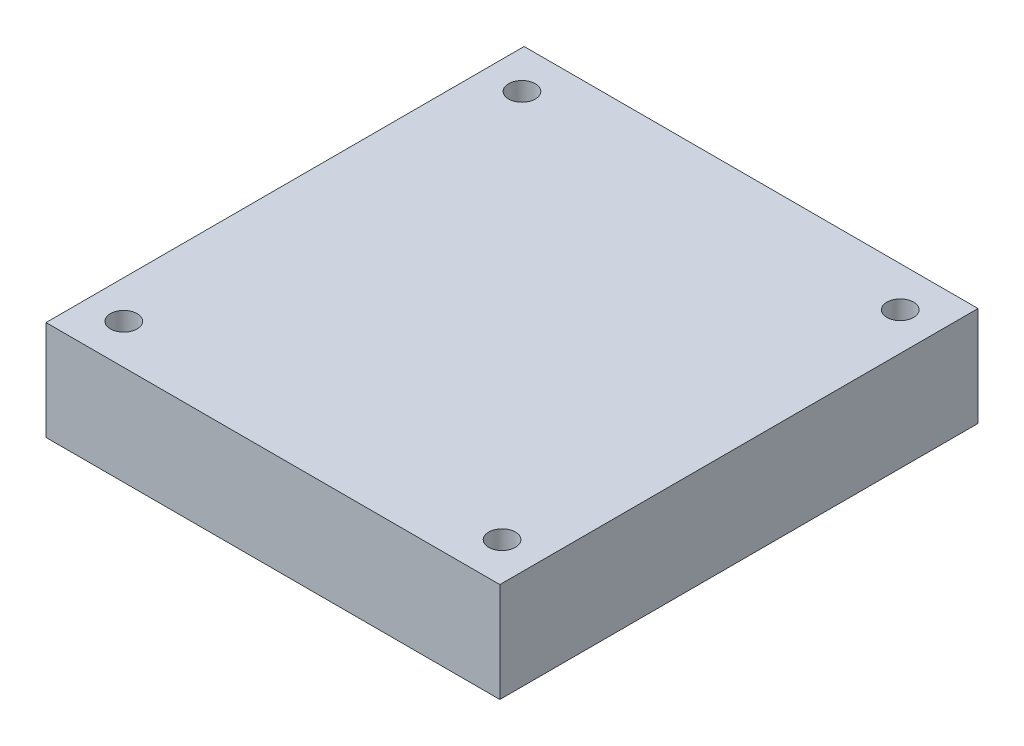
ISO-10303-21;
HEADER;
FILE_DESCRIPTION(('STEP AP214'),'2;1');
FILE_NAME('part.step','',(''),(''),'','','');
FILE_SCHEMA(('AUTOMOTIVE_DESIGN { 1 0 10303 214 1 1 1 1 }'));
ENDSEC;
DATA;
#1=APPLICATION_CONTEXT('core data for automotive mechanical design processes');
#2=APPLICATION_PROTOCOL_DEFINITION('international standard','automotive_design',2000,#1);
#3=PRODUCT_CONTEXT('',#1,'mechanical');
#4=PRODUCT('Part','Part','',(#3));
#5=PRODUCT_RELATED_PRODUCT_CATEGORY('part','',(#4));
#6=PRODUCT_DEFINITION_FORMATION('','',#4);
#7=PRODUCT_DEFINITION_CONTEXT('part definition',#1,'design');
#8=PRODUCT_DEFINITION('design','',#6,#7);
#9=PRODUCT_DEFINITION_SHAPE('','',#8);
#10=(LENGTH_UNIT() NAMED_UNIT(*) SI_UNIT(.MILLI.,.METRE.));
#11=(NAMED_UNIT(*) PLANE_ANGLE_UNIT() SI_UNIT($,.RADIAN.));
#12=(NAMED_UNIT(*) SI_UNIT($,.STERADIAN.) SOLID_ANGLE_UNIT());
#13=UNCERTAINTY_MEASURE_WITH_UNIT(LENGTH_MEASURE(1.E-05),#10,'distance_accuracy_value','');
#14=(GEOMETRIC_REPRESENTATION_CONTEXT(3) GLOBAL_UNCERTAINTY_ASSIGNED_CONTEXT((#13)) GLOBAL_UNIT_ASSIGNED_CONTEXT((#10,
#11,#12)) REPRESENTATION_CONTEXT('',''));
#15=CARTESIAN_POINT('',(0.,0.,0.));
#16=DIRECTION('',(0.,0.,1.));
#17=DIRECTION('',(1.,0.,0.));
#18=AXIS2_PLACEMENT_3D('',#15,#16,#17);
#19=CARTESIAN_POINT('',(-28.95,0.,30.5));
#20=DIRECTION('',(0.,1.,0.));
#21=DIRECTION('',(0.,0.,1.));
#22=AXIS2_PLACEMENT_3D('',#19,#20,#21);
#23=PLANE('',#22);
#24=CARTESIAN_POINT('',(24.13,0.,-25.4));
#25=DIRECTION('',(0.,-1.,0.));
#26=DIRECTION('',(0.,0.,-1.));
#27=AXIS2_PLACEMENT_3D('',#24,#25,#26);
#28=CIRCLE('',#27,1.7);
#29=CARTESIAN_POINT('',(24.13,0.,-27.1));
#30=VERTEX_POINT('',#29);
#31=EDGE_CURVE('E153',#30,#30,#28,.T.);
#32=ORIENTED_EDGE('',*,*,#31,.F.);
#33=EDGE_LOOP('',(#32));
#34=FACE_BOUND('',#33,.T.);
#35=CARTESIAN_POINT('',(-24.13,0.,-25.4));
#36=DIRECTION('',(0.,-1.,0.));
#37=DIRECTION('',(0.,0.,-1.));
#38=AXIS2_PLACEMENT_3D('',#35,#36,#37);
#39=CIRCLE('',#38,1.7);
#40=CARTESIAN_POINT('',(-24.13,0.,-27.1));
#41=VERTEX_POINT('',#40);
#42=EDGE_CURVE('E157',#41,#41,#39,.T.);
#43=ORIENTED_EDGE('',*,*,#42,.F.);
#44=EDGE_LOOP('',(#43));
#45=FACE_BOUND('',#44,.T.);
#46=CARTESIAN_POINT('',(-24.13,0.,25.4));
#47=DIRECTION('',(0.,-1.,0.));
#48=DIRECTION('',(0.,0.,-1.));
#49=AXIS2_PLACEMENT_3D('',#46,#47,#48);
#50=CIRCLE('',#49,1.7);
#51=CARTESIAN_POINT('',(-24.13,0.,23.7));
#52=VERTEX_POINT('',#51);
#53=EDGE_CURVE('E166',#52,#52,#50,.T.);
#54=ORIENTED_EDGE('',*,*,#53,.F.);
#55=EDGE_LOOP('',(#54));
#56=FACE_BOUND('',#55,.T.);
#57=DIRECTION('',(0.,0.,1.));
#58=VECTOR('',#57,1.);
#59=CARTESIAN_POINT('',(-28.95,0.,-30.5));
#60=LINE('',#59,#58);
#61=CARTESIAN_POINT('',(-28.95,0.,-30.5));
#62=VERTEX_POINT('',#61);
#63=CARTESIAN_POINT('',(-28.95,0.,30.5));
#64=VERTEX_POINT('',#63);
#65=EDGE_CURVE('E78',#62,#64,#60,.T.);
#66=ORIENTED_EDGE('',*,*,#65,.F.);
#67=DIRECTION('',(-1.,0.,0.));
#68=VECTOR('',#67,1.);
#69=CARTESIAN_POINT('',(-28.95,0.,-30.5));
#70=LINE('',#69,#68);
#71=CARTESIAN_POINT('',(28.95,0.,-30.5));
#72=VERTEX_POINT('',#71);
#73=EDGE_CURVE('E99',#72,#62,#70,.T.);
#74=ORIENTED_EDGE('',*,*,#73,.F.);
#75=DIRECTION('',(0.,0.,-1.));
#76=VECTOR('',#75,1.);
#77=CARTESIAN_POINT('',(28.95,0.,-30.5));
#78=LINE('',#77,#76);
#79=CARTESIAN_POINT('',(28.95,0.,30.5));
#80=VERTEX_POINT('',#79);
#81=EDGE_CURVE('E79',#80,#72,#78,.T.);
#82=ORIENTED_EDGE('',*,*,#81,.F.);
#83=DIRECTION('',(1.,0.,0.));
#84=VECTOR('',#83,1.);
#85=CARTESIAN_POINT('',(-28.95,0.,30.5));
#86=LINE('',#85,#84);
#87=EDGE_CURVE('E74',#64,#80,#86,.T.);
#88=ORIENTED_EDGE('',*,*,#87,.F.);
#89=EDGE_LOOP('',(#66,#74,#82,#88));
#90=FACE_BOUND('',#89,.T.);
#91=CARTESIAN_POINT('',(24.13,0.,25.4));
#92=DIRECTION('',(0.,-1.,0.));
#93=DIRECTION('',(0.,0.,-1.));
#94=AXIS2_PLACEMENT_3D('',#91,#92,#93);
#95=CIRCLE('',#94,1.7);
#96=CARTESIAN_POINT('',(24.13,0.,23.7));
#97=VERTEX_POINT('',#96);
#98=EDGE_CURVE('E91',#97,#97,#95,.T.);
#99=ORIENTED_EDGE('',*,*,#98,.F.);
#100=EDGE_LOOP('',(#99));
#101=FACE_BOUND('',#100,.T.);
#102=ADVANCED_FACE('F33',(#34,#45,#56,#90,#101),#23,.F.);
#103=CARTESIAN_POINT('',(-28.95,12.7,-30.5));
#104=DIRECTION('',(1.,0.,0.));
#105=DIRECTION('',(0.,0.,-1.));
#106=AXIS2_PLACEMENT_3D('',#103,#104,#105);
#107=PLANE('',#106);
#108=ORIENTED_EDGE('',*,*,#65,.T.);
#109=DIRECTION('',(0.,-1.,0.));
#110=VECTOR('',#109,1.);
#111=CARTESIAN_POINT('',(-28.95,12.7,30.5));
#112=LINE('',#111,#110);
#113=CARTESIAN_POINT('',(-28.95,12.7,30.5));
#114=VERTEX_POINT('',#113);
#115=EDGE_CURVE('E11',#114,#64,#112,.T.);
#116=ORIENTED_EDGE('',*,*,#115,.F.);
#117=DIRECTION('',(0.,0.,1.));
#118=VECTOR('',#117,1.);
#119=CARTESIAN_POINT('',(-28.95,12.7,-30.5));
#120=LINE('',#119,#118);
#121=CARTESIAN_POINT('',(-28.95,12.7,-30.5));
#122=VERTEX_POINT('',#121);
#123=EDGE_CURVE('E101',#122,#114,#120,.T.);
#124=ORIENTED_EDGE('',*,*,#123,.F.);
#125=DIRECTION('',(0.,-1.,0.));
#126=VECTOR('',#125,1.);
#127=CARTESIAN_POINT('',(-28.95,12.7,-30.5));
#128=LINE('',#127,#126);
#129=EDGE_CURVE('E90',#122,#62,#128,.T.);
#130=ORIENTED_EDGE('',*,*,#129,.T.);
#131=EDGE_LOOP('',(#108,#116,#124,#130));
#132=FACE_BOUND('',#131,.T.);
#133=ADVANCED_FACE('F35',(#132),#107,.F.);
#134=CARTESIAN_POINT('',(-28.95,12.7,30.5));
#135=DIRECTION('',(0.,0.,-1.));
#136=DIRECTION('',(-1.,0.,0.));
#137=AXIS2_PLACEMENT_3D('',#134,#135,#136);
#138=PLANE('',#137);
#139=ORIENTED_EDGE('',*,*,#87,.T.);
#140=DIRECTION('',(0.,-1.,0.));
#141=VECTOR('',#140,1.);
#142=CARTESIAN_POINT('',(28.95,12.7,30.5));
#143=LINE('',#142,#141);
#144=CARTESIAN_POINT('',(28.95,12.7,30.5));
#145=VERTEX_POINT('',#144);
#146=EDGE_CURVE('E41',#145,#80,#143,.T.);
#147=ORIENTED_EDGE('',*,*,#146,.F.);
#148=DIRECTION('',(1.,0.,0.));
#149=VECTOR('',#148,1.);
#150=CARTESIAN_POINT('',(-28.95,12.7,30.5));
#151=LINE('',#150,#149);
#152=EDGE_CURVE('E86',#114,#145,#151,.T.);
#153=ORIENTED_EDGE('',*,*,#152,.F.);
#154=ORIENTED_EDGE('',*,*,#115,.T.);
#155=EDGE_LOOP('',(#139,#147,#153,#154));
#156=FACE_BOUND('',#155,.T.);
#157=ADVANCED_FACE('F85',(#156),#138,.F.);
#158=CARTESIAN_POINT('',(28.95,12.7,-30.5));
#159=DIRECTION('',(-1.,0.,0.));
#160=DIRECTION('',(0.,0.,1.));
#161=AXIS2_PLACEMENT_3D('',#158,#159,#160);
#162=PLANE('',#161);
#163=ORIENTED_EDGE('',*,*,#81,.T.);
#164=DIRECTION('',(0.,-1.,0.));
#165=VECTOR('',#164,1.);
#166=CARTESIAN_POINT('',(28.95,12.7,-30.5));
#167=LINE('',#166,#165);
#168=CARTESIAN_POINT('',(28.95,12.7,-30.5));
#169=VERTEX_POINT('',#168);
#170=EDGE_CURVE('E107',#169,#72,#167,.T.);
#171=ORIENTED_EDGE('',*,*,#170,.F.);
#172=DIRECTION('',(0.,0.,-1.));
#173=VECTOR('',#172,1.);
#174=CARTESIAN_POINT('',(28.95,12.7,-30.5));
#175=LINE('',#174,#173);
#176=EDGE_CURVE('E53',#145,#169,#175,.T.);
#177=ORIENTED_EDGE('',*,*,#176,.F.);
#178=ORIENTED_EDGE('',*,*,#146,.T.);
#179=EDGE_LOOP('',(#163,#171,#177,#178));
#180=FACE_BOUND('',#179,.T.);
#181=ADVANCED_FACE('F110',(#180),#162,.F.);
#182=CARTESIAN_POINT('',(-28.95,12.7,-30.5));
#183=DIRECTION('',(0.,0.,1.));
#184=DIRECTION('',(1.,0.,0.));
#185=AXIS2_PLACEMENT_3D('',#182,#183,#184);
#186=PLANE('',#185);
#187=ORIENTED_EDGE('',*,*,#73,.T.);
#188=ORIENTED_EDGE('',*,*,#129,.F.);
#189=DIRECTION('',(-1.,0.,0.));
#190=VECTOR('',#189,1.);
#191=CARTESIAN_POINT('',(-28.95,12.7,-30.5));
#192=LINE('',#191,#190);
#193=EDGE_CURVE('E48',#169,#122,#192,.T.);
#194=ORIENTED_EDGE('',*,*,#193,.F.);
#195=ORIENTED_EDGE('',*,*,#170,.T.);
#196=EDGE_LOOP('',(#187,#188,#194,#195));
#197=FACE_BOUND('',#196,.T.);
#198=ADVANCED_FACE('F112',(#197),#186,.F.);
#199=CARTESIAN_POINT('',(-28.95,12.7,30.5));
#200=DIRECTION('',(0.,1.,0.));
#201=DIRECTION('',(0.,0.,1.));
#202=AXIS2_PLACEMENT_3D('',#199,#200,#201);
#203=PLANE('',#202);
#204=CARTESIAN_POINT('',(24.13,12.7,-25.4));
#205=DIRECTION('',(0.,-1.,0.));
#206=DIRECTION('',(0.,0.,-1.));
#207=AXIS2_PLACEMENT_3D('',#204,#205,#206);
#208=CIRCLE('',#207,1.7);
#209=CARTESIAN_POINT('',(24.13,12.7,-27.1));
#210=VERTEX_POINT('',#209);
#211=EDGE_CURVE('E151',#210,#210,#208,.T.);
#212=ORIENTED_EDGE('',*,*,#211,.T.);
#213=EDGE_LOOP('',(#212));
#214=FACE_BOUND('',#213,.T.);
#215=CARTESIAN_POINT('',(-24.13,12.7,-25.4));
#216=DIRECTION('',(0.,-1.,0.));
#217=DIRECTION('',(0.,0.,-1.));
#218=AXIS2_PLACEMENT_3D('',#215,#216,#217);
#219=CIRCLE('',#218,1.7);
#220=CARTESIAN_POINT('',(-24.13,12.7,-27.1));
#221=VERTEX_POINT('',#220);
#222=EDGE_CURVE('E154',#221,#221,#219,.T.);
#223=ORIENTED_EDGE('',*,*,#222,.T.);
#224=EDGE_LOOP('',(#223));
#225=FACE_BOUND('',#224,.T.);
#226=CARTESIAN_POINT('',(-24.13,12.7,25.4));
#227=DIRECTION('',(0.,-1.,0.));
#228=DIRECTION('',(0.,0.,-1.));
#229=AXIS2_PLACEMENT_3D('',#226,#227,#228);
#230=CIRCLE('',#229,1.7);
#231=CARTESIAN_POINT('',(-24.13,12.7,23.7));
#232=VERTEX_POINT('',#231);
#233=EDGE_CURVE('E163',#232,#232,#230,.T.);
#234=ORIENTED_EDGE('',*,*,#233,.T.);
#235=EDGE_LOOP('',(#234));
#236=FACE_BOUND('',#235,.T.);
#237=CARTESIAN_POINT('',(24.13,12.7,25.4));
#238=DIRECTION('',(0.,-1.,0.));
#239=DIRECTION('',(0.,0.,-1.));
#240=AXIS2_PLACEMENT_3D('',#237,#238,#239);
#241=CIRCLE('',#240,1.7);
#242=CARTESIAN_POINT('',(24.13,12.7,23.7));
#243=VERTEX_POINT('',#242);
#244=EDGE_CURVE('E94',#243,#243,#241,.T.);
#245=ORIENTED_EDGE('',*,*,#244,.T.);
#246=EDGE_LOOP('',(#245));
#247=FACE_BOUND('',#246,.T.);
#248=ORIENTED_EDGE('',*,*,#123,.T.);
#249=ORIENTED_EDGE('',*,*,#152,.T.);
#250=ORIENTED_EDGE('',*,*,#176,.T.);
#251=ORIENTED_EDGE('',*,*,#193,.T.);
#252=EDGE_LOOP('',(#248,#249,#250,#251));
#253=FACE_BOUND('',#252,.T.);
#254=ADVANCED_FACE('F113',(#214,#225,#236,#247,#253),#203,.T.);
#255=CARTESIAN_POINT('',(24.13,0.,25.4));
#256=DIRECTION('',(0.,-1.,0.));
#257=DIRECTION('',(0.,0.,-1.));
#258=AXIS2_PLACEMENT_3D('',#255,#256,#257);
#259=CYLINDRICAL_SURFACE('',#258,1.7);
#260=ORIENTED_EDGE('',*,*,#244,.F.);
#261=EDGE_LOOP('',(#260));
#262=FACE_BOUND('',#261,.T.);
#263=ORIENTED_EDGE('',*,*,#98,.T.);
#264=EDGE_LOOP('',(#263));
#265=FACE_BOUND('',#264,.T.);
#266=ADVANCED_FACE('F115',(#262,#265),#259,.F.);
#267=CARTESIAN_POINT('',(-24.13,0.,25.4));
#268=DIRECTION('',(0.,-1.,0.));
#269=DIRECTION('',(0.,0.,-1.));
#270=AXIS2_PLACEMENT_3D('',#267,#268,#269);
#271=CYLINDRICAL_SURFACE('',#270,1.7);
#272=ORIENTED_EDGE('',*,*,#233,.F.);
#273=EDGE_LOOP('',(#272));
#274=FACE_BOUND('',#273,.T.);
#275=ORIENTED_EDGE('',*,*,#53,.T.);
#276=EDGE_LOOP('',(#275));
#277=FACE_BOUND('',#276,.T.);
#278=ADVANCED_FACE('F122',(#274,#277),#271,.F.);
#279=CARTESIAN_POINT('',(-24.13,0.,-25.4));
#280=DIRECTION('',(0.,-1.,0.));
#281=DIRECTION('',(0.,0.,-1.));
#282=AXIS2_PLACEMENT_3D('',#279,#280,#281);
#283=CYLINDRICAL_SURFACE('',#282,1.7);
#284=ORIENTED_EDGE('',*,*,#222,.F.);
#285=EDGE_LOOP('',(#284));
#286=FACE_BOUND('',#285,.T.);
#287=ORIENTED_EDGE('',*,*,#42,.T.);
#288=EDGE_LOOP('',(#287));
#289=FACE_BOUND('',#288,.T.);
#290=ADVANCED_FACE('F139',(#286,#289),#283,.F.);
#291=CARTESIAN_POINT('',(24.13,0.,-25.4));
#292=DIRECTION('',(0.,-1.,0.));
#293=DIRECTION('',(0.,0.,-1.));
#294=AXIS2_PLACEMENT_3D('',#291,#292,#293);
#295=CYLINDRICAL_SURFACE('',#294,1.7);
#296=ORIENTED_EDGE('',*,*,#211,.F.);
#297=EDGE_LOOP('',(#296));
#298=FACE_BOUND('',#297,.T.);
#299=ORIENTED_EDGE('',*,*,#31,.T.);
#300=EDGE_LOOP('',(#299));
#301=FACE_BOUND('',#300,.T.);
#302=ADVANCED_FACE('F143',(#298,#301),#295,.F.);
#303=CLOSED_SHELL('',(#102,#133,#157,#181,#198,#254,#266,#278,#290,#302));
#304=MANIFOLD_SOLID_BREP('B2',#303);
#305=ADVANCED_BREP_SHAPE_REPRESENTATION('',(#18,#304),#14);
#306=SHAPE_DEFINITION_REPRESENTATION(#9,#305);
ENDSEC;
END-ISO-10303-21;
